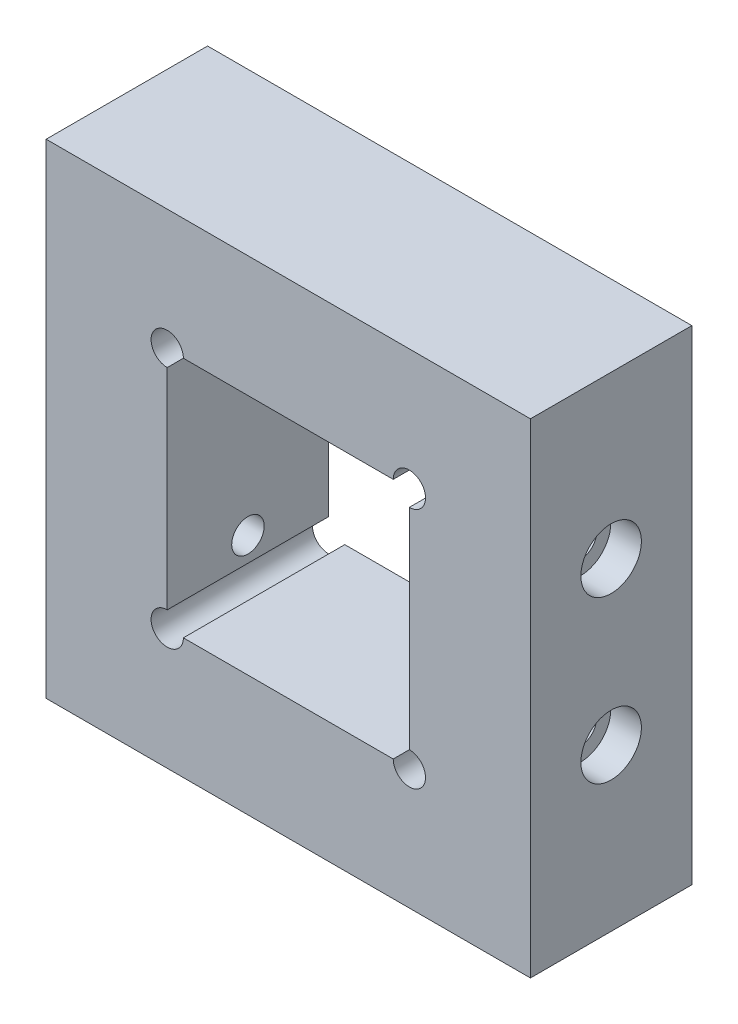
ISO-10303-21;
HEADER;
FILE_DESCRIPTION(('STEP AP214'),'2;1');
FILE_NAME('part.step','',(''),(''),'','','');
FILE_SCHEMA(('AUTOMOTIVE_DESIGN { 1 0 10303 214 1 1 1 1 }'));
ENDSEC;
DATA;
#1=APPLICATION_CONTEXT('core data for automotive mechanical design processes');
#2=APPLICATION_PROTOCOL_DEFINITION('international standard','automotive_design',2000,#1);
#3=PRODUCT_CONTEXT('',#1,'mechanical');
#4=PRODUCT('Part','Part','',(#3));
#5=PRODUCT_RELATED_PRODUCT_CATEGORY('part','',(#4));
#6=PRODUCT_DEFINITION_FORMATION('','',#4);
#7=PRODUCT_DEFINITION_CONTEXT('part definition',#1,'design');
#8=PRODUCT_DEFINITION('design','',#6,#7);
#9=PRODUCT_DEFINITION_SHAPE('','',#8);
#10=(LENGTH_UNIT() NAMED_UNIT(*) SI_UNIT(.MILLI.,.METRE.));
#11=(NAMED_UNIT(*) PLANE_ANGLE_UNIT() SI_UNIT($,.RADIAN.));
#12=(NAMED_UNIT(*) SI_UNIT($,.STERADIAN.) SOLID_ANGLE_UNIT());
#13=UNCERTAINTY_MEASURE_WITH_UNIT(LENGTH_MEASURE(1.E-05),#10,'distance_accuracy_value','');
#14=(GEOMETRIC_REPRESENTATION_CONTEXT(3) GLOBAL_UNCERTAINTY_ASSIGNED_CONTEXT((#13)) GLOBAL_UNIT_ASSIGNED_CONTEXT((#10,
#11,#12)) REPRESENTATION_CONTEXT('',''));
#15=CARTESIAN_POINT('',(0.,0.,0.));
#16=DIRECTION('',(0.,0.,1.));
#17=DIRECTION('',(1.,0.,0.));
#18=AXIS2_PLACEMENT_3D('',#15,#16,#17);
#19=CARTESIAN_POINT('',(0.,0.,12.7));
#20=DIRECTION('',(0.,0.,1.));
#21=DIRECTION('',(1.,0.,0.));
#22=AXIS2_PLACEMENT_3D('',#19,#20,#21);
#23=PLANE('',#22);
#24=DIRECTION('',(0.,-1.,0.));
#25=VECTOR('',#24,1.);
#26=CARTESIAN_POINT('',(-38.1,38.1,12.7));
#27=LINE('',#26,#25);
#28=CARTESIAN_POINT('',(-38.1,38.1,12.7));
#29=VERTEX_POINT('',#28);
#30=CARTESIAN_POINT('',(-38.1,-38.1,12.7));
#31=VERTEX_POINT('',#30);
#32=EDGE_CURVE('E158',#29,#31,#27,.T.);
#33=ORIENTED_EDGE('',*,*,#32,.T.);
#34=DIRECTION('',(1.,0.,0.));
#35=VECTOR('',#34,1.);
#36=CARTESIAN_POINT('',(-38.1,-38.1,12.7));
#37=LINE('',#36,#35);
#38=CARTESIAN_POINT('',(38.1,-38.1,12.7));
#39=VERTEX_POINT('',#38);
#40=EDGE_CURVE('E161',#31,#39,#37,.T.);
#41=ORIENTED_EDGE('',*,*,#40,.T.);
#42=DIRECTION('',(0.,1.,0.));
#43=VECTOR('',#42,1.);
#44=CARTESIAN_POINT('',(38.1,38.1,12.7));
#45=LINE('',#44,#43);
#46=CARTESIAN_POINT('',(38.1,38.1,12.7));
#47=VERTEX_POINT('',#46);
#48=EDGE_CURVE('E164',#39,#47,#45,.T.);
#49=ORIENTED_EDGE('',*,*,#48,.T.);
#50=DIRECTION('',(-1.,0.,0.));
#51=VECTOR('',#50,1.);
#52=CARTESIAN_POINT('',(-38.1,38.1,12.7));
#53=LINE('',#52,#51);
#54=EDGE_CURVE('E166',#47,#29,#53,.T.);
#55=ORIENTED_EDGE('',*,*,#54,.T.);
#56=EDGE_LOOP('',(#33,#41,#49,#55));
#57=FACE_BOUND('',#56,.T.);
#58=DIRECTION('',(1.,0.,0.));
#59=VECTOR('',#58,1.);
#60=CARTESIAN_POINT('',(-19.05,-19.05,12.7));
#61=LINE('',#60,#59);
#62=CARTESIAN_POINT('',(-16.51,-19.05,12.7));
#63=VERTEX_POINT('',#62);
#64=CARTESIAN_POINT('',(16.51,-19.05,12.7));
#65=VERTEX_POINT('',#64);
#66=EDGE_CURVE('E137',#63,#65,#61,.T.);
#67=ORIENTED_EDGE('',*,*,#66,.F.);
#68=CARTESIAN_POINT('',(-19.05,-19.05,12.7));
#69=DIRECTION('',(0.,0.,-1.));
#70=DIRECTION('',(-1.,0.,0.));
#71=AXIS2_PLACEMENT_3D('',#68,#69,#70);
#72=CIRCLE('',#71,2.54);
#73=CARTESIAN_POINT('',(-19.05,-16.51,12.7));
#74=VERTEX_POINT('',#73);
#75=EDGE_CURVE('E49',#63,#74,#72,.T.);
#76=ORIENTED_EDGE('',*,*,#75,.T.);
#77=DIRECTION('',(0.,-1.,0.));
#78=VECTOR('',#77,1.);
#79=CARTESIAN_POINT('',(-19.05,19.05,12.7));
#80=LINE('',#79,#78);
#81=CARTESIAN_POINT('',(-19.05,16.51,12.7));
#82=VERTEX_POINT('',#81);
#83=EDGE_CURVE('E135',#82,#74,#80,.T.);
#84=ORIENTED_EDGE('',*,*,#83,.F.);
#85=CARTESIAN_POINT('',(-19.05,19.05,12.7));
#86=DIRECTION('',(0.,0.,-1.));
#87=DIRECTION('',(-1.,0.,0.));
#88=AXIS2_PLACEMENT_3D('',#85,#86,#87);
#89=CIRCLE('',#88,2.54);
#90=CARTESIAN_POINT('',(-16.51,19.05,12.7));
#91=VERTEX_POINT('',#90);
#92=EDGE_CURVE('E257',#82,#91,#89,.T.);
#93=ORIENTED_EDGE('',*,*,#92,.T.);
#94=DIRECTION('',(-1.,0.,0.));
#95=VECTOR('',#94,1.);
#96=CARTESIAN_POINT('',(-19.05,19.05,12.7));
#97=LINE('',#96,#95);
#98=CARTESIAN_POINT('',(16.51,19.05,12.7));
#99=VERTEX_POINT('',#98);
#100=EDGE_CURVE('E154',#99,#91,#97,.T.);
#101=ORIENTED_EDGE('',*,*,#100,.F.);
#102=CARTESIAN_POINT('',(19.05,19.05,12.7));
#103=DIRECTION('',(0.,0.,1.));
#104=DIRECTION('',(1.,0.,0.));
#105=AXIS2_PLACEMENT_3D('',#102,#103,#104);
#106=CIRCLE('',#105,2.54);
#107=CARTESIAN_POINT('',(19.05,16.51,12.7));
#108=VERTEX_POINT('',#107);
#109=EDGE_CURVE('E298',#108,#99,#106,.T.);
#110=ORIENTED_EDGE('',*,*,#109,.F.);
#111=DIRECTION('',(0.,1.,0.));
#112=VECTOR('',#111,1.);
#113=CARTESIAN_POINT('',(19.05,19.05,12.7));
#114=LINE('',#113,#112);
#115=CARTESIAN_POINT('',(19.05,-16.51,12.7));
#116=VERTEX_POINT('',#115);
#117=EDGE_CURVE('E144',#116,#108,#114,.T.);
#118=ORIENTED_EDGE('',*,*,#117,.F.);
#119=CARTESIAN_POINT('',(19.05,-19.05,12.7));
#120=DIRECTION('',(0.,0.,1.));
#121=DIRECTION('',(1.,0.,0.));
#122=AXIS2_PLACEMENT_3D('',#119,#120,#121);
#123=CIRCLE('',#122,2.54);
#124=EDGE_CURVE('E288',#65,#116,#123,.T.);
#125=ORIENTED_EDGE('',*,*,#124,.F.);
#126=EDGE_LOOP('',(#67,#76,#84,#93,#101,#110,#118,#125));
#127=FACE_BOUND('',#126,.T.);
#128=ADVANCED_FACE('F34',(#57,#127),#23,.T.);
#129=CARTESIAN_POINT('',(0.,0.,-12.7));
#130=DIRECTION('',(0.,0.,1.));
#131=DIRECTION('',(1.,0.,0.));
#132=AXIS2_PLACEMENT_3D('',#129,#130,#131);
#133=PLANE('',#132);
#134=DIRECTION('',(0.,-1.,0.));
#135=VECTOR('',#134,1.);
#136=CARTESIAN_POINT('',(-38.1,38.1,-12.7));
#137=LINE('',#136,#135);
#138=CARTESIAN_POINT('',(-38.1,38.1,-12.7));
#139=VERTEX_POINT('',#138);
#140=CARTESIAN_POINT('',(-38.1,-38.1,-12.7));
#141=VERTEX_POINT('',#140);
#142=EDGE_CURVE('E169',#139,#141,#137,.T.);
#143=ORIENTED_EDGE('',*,*,#142,.F.);
#144=DIRECTION('',(-1.,0.,0.));
#145=VECTOR('',#144,1.);
#146=CARTESIAN_POINT('',(-38.1,38.1,-12.7));
#147=LINE('',#146,#145);
#148=CARTESIAN_POINT('',(38.1,38.1,-12.7));
#149=VERTEX_POINT('',#148);
#150=EDGE_CURVE('E162',#149,#139,#147,.T.);
#151=ORIENTED_EDGE('',*,*,#150,.F.);
#152=DIRECTION('',(0.,1.,0.));
#153=VECTOR('',#152,1.);
#154=CARTESIAN_POINT('',(38.1,38.1,-12.7));
#155=LINE('',#154,#153);
#156=CARTESIAN_POINT('',(38.1,-38.1,-12.7));
#157=VERTEX_POINT('',#156);
#158=EDGE_CURVE('E174',#157,#149,#155,.T.);
#159=ORIENTED_EDGE('',*,*,#158,.F.);
#160=DIRECTION('',(1.,0.,0.));
#161=VECTOR('',#160,1.);
#162=CARTESIAN_POINT('',(-38.1,-38.1,-12.7));
#163=LINE('',#162,#161);
#164=EDGE_CURVE('E172',#141,#157,#163,.T.);
#165=ORIENTED_EDGE('',*,*,#164,.F.);
#166=EDGE_LOOP('',(#143,#151,#159,#165));
#167=FACE_BOUND('',#166,.T.);
#168=CARTESIAN_POINT('',(-19.05,-19.05,-12.7));
#169=DIRECTION('',(0.,0.,1.));
#170=DIRECTION('',(1.,0.,0.));
#171=AXIS2_PLACEMENT_3D('',#168,#169,#170);
#172=CIRCLE('',#171,2.54);
#173=CARTESIAN_POINT('',(-19.05,-16.51,-12.7));
#174=VERTEX_POINT('',#173);
#175=CARTESIAN_POINT('',(-16.51,-19.05,-12.7));
#176=VERTEX_POINT('',#175);
#177=EDGE_CURVE('E124',#174,#176,#172,.T.);
#178=ORIENTED_EDGE('',*,*,#177,.T.);
#179=DIRECTION('',(1.,0.,0.));
#180=VECTOR('',#179,1.);
#181=CARTESIAN_POINT('',(-19.05,-19.05,-12.7));
#182=LINE('',#181,#180);
#183=CARTESIAN_POINT('',(16.51,-19.05,-12.7));
#184=VERTEX_POINT('',#183);
#185=EDGE_CURVE('E250',#176,#184,#182,.T.);
#186=ORIENTED_EDGE('',*,*,#185,.T.);
#187=CARTESIAN_POINT('',(19.05,-19.05,-12.7));
#188=DIRECTION('',(0.,0.,1.));
#189=DIRECTION('',(1.,0.,0.));
#190=AXIS2_PLACEMENT_3D('',#187,#188,#189);
#191=CIRCLE('',#190,2.54);
#192=CARTESIAN_POINT('',(19.05,-16.51,-12.7));
#193=VERTEX_POINT('',#192);
#194=EDGE_CURVE('E290',#193,#184,#191,.F.);
#195=ORIENTED_EDGE('',*,*,#194,.F.);
#196=DIRECTION('',(0.,1.,0.));
#197=VECTOR('',#196,1.);
#198=CARTESIAN_POINT('',(19.05,19.05,-12.7));
#199=LINE('',#198,#197);
#200=CARTESIAN_POINT('',(19.05,16.51,-12.7));
#201=VERTEX_POINT('',#200);
#202=EDGE_CURVE('E323',#193,#201,#199,.T.);
#203=ORIENTED_EDGE('',*,*,#202,.T.);
#204=CARTESIAN_POINT('',(19.05,19.05,-12.7));
#205=DIRECTION('',(0.,0.,1.));
#206=DIRECTION('',(1.,0.,0.));
#207=AXIS2_PLACEMENT_3D('',#204,#205,#206);
#208=CIRCLE('',#207,2.54);
#209=CARTESIAN_POINT('',(16.51,19.05,-12.7));
#210=VERTEX_POINT('',#209);
#211=EDGE_CURVE('E300',#210,#201,#208,.F.);
#212=ORIENTED_EDGE('',*,*,#211,.F.);
#213=DIRECTION('',(-1.,0.,0.));
#214=VECTOR('',#213,1.);
#215=CARTESIAN_POINT('',(-19.05,19.05,-12.7));
#216=LINE('',#215,#214);
#217=CARTESIAN_POINT('',(-16.51,19.05,-12.7));
#218=VERTEX_POINT('',#217);
#219=EDGE_CURVE('E150',#210,#218,#216,.T.);
#220=ORIENTED_EDGE('',*,*,#219,.T.);
#221=CARTESIAN_POINT('',(-19.05,19.05,-12.7));
#222=DIRECTION('',(0.,0.,1.));
#223=DIRECTION('',(1.,0.,0.));
#224=AXIS2_PLACEMENT_3D('',#221,#222,#223);
#225=CIRCLE('',#224,2.54);
#226=CARTESIAN_POINT('',(-19.05,16.51,-12.7));
#227=VERTEX_POINT('',#226);
#228=EDGE_CURVE('E57',#218,#227,#225,.T.);
#229=ORIENTED_EDGE('',*,*,#228,.T.);
#230=DIRECTION('',(0.,-1.,0.));
#231=VECTOR('',#230,1.);
#232=CARTESIAN_POINT('',(-19.05,19.05,-12.7));
#233=LINE('',#232,#231);
#234=EDGE_CURVE('E157',#227,#174,#233,.T.);
#235=ORIENTED_EDGE('',*,*,#234,.T.);
#236=EDGE_LOOP('',(#178,#186,#195,#203,#212,#220,#229,#235));
#237=FACE_BOUND('',#236,.T.);
#238=ADVANCED_FACE('F192',(#167,#237),#133,.F.);
#239=CARTESIAN_POINT('',(-19.05,19.05,-12.7));
#240=DIRECTION('',(-1.,0.,0.));
#241=DIRECTION('',(0.,-1.,0.));
#242=AXIS2_PLACEMENT_3D('',#239,#240,#241);
#243=PLANE('',#242);
#244=CARTESIAN_POINT('',(-19.05,12.7,0.));
#245=DIRECTION('',(-1.,0.,0.));
#246=DIRECTION('',(0.,-1.,0.));
#247=AXIS2_PLACEMENT_3D('',#244,#245,#246);
#248=CIRCLE('',#247,2.5527);
#249=CARTESIAN_POINT('',(-19.05,10.1473,0.));
#250=VERTEX_POINT('',#249);
#251=EDGE_CURVE('E269',#250,#250,#248,.T.);
#252=ORIENTED_EDGE('',*,*,#251,.T.);
#253=EDGE_LOOP('',(#252));
#254=FACE_BOUND('',#253,.T.);
#255=CARTESIAN_POINT('',(-19.05,-12.7,0.));
#256=DIRECTION('',(-1.,0.,0.));
#257=DIRECTION('',(0.,-1.,0.));
#258=AXIS2_PLACEMENT_3D('',#255,#256,#257);
#259=CIRCLE('',#258,2.5527);
#260=CARTESIAN_POINT('',(-19.05,-15.2527,0.));
#261=VERTEX_POINT('',#260);
#262=EDGE_CURVE('E281',#261,#261,#259,.T.);
#263=ORIENTED_EDGE('',*,*,#262,.T.);
#264=EDGE_LOOP('',(#263));
#265=FACE_BOUND('',#264,.T.);
#266=DIRECTION('',(0.,0.,1.));
#267=VECTOR('',#266,1.);
#268=CARTESIAN_POINT('',(-19.05,-16.51,-12.701));
#269=LINE('',#268,#267);
#270=EDGE_CURVE('E121',#74,#174,#269,.F.);
#271=ORIENTED_EDGE('',*,*,#270,.T.);
#272=ORIENTED_EDGE('',*,*,#234,.F.);
#273=DIRECTION('',(0.,0.,1.));
#274=VECTOR('',#273,1.);
#275=CARTESIAN_POINT('',(-19.05,16.51,-12.701));
#276=LINE('',#275,#274);
#277=EDGE_CURVE('E141',#227,#82,#276,.T.);
#278=ORIENTED_EDGE('',*,*,#277,.T.);
#279=ORIENTED_EDGE('',*,*,#83,.T.);
#280=EDGE_LOOP('',(#271,#272,#278,#279));
#281=FACE_BOUND('',#280,.T.);
#282=ADVANCED_FACE('F140',(#254,#265,#281),#243,.F.);
#283=CARTESIAN_POINT('',(-19.05,-19.05,-12.7));
#284=DIRECTION('',(0.,-1.,0.));
#285=DIRECTION('',(0.,0.,-1.));
#286=AXIS2_PLACEMENT_3D('',#283,#284,#285);
#287=PLANE('',#286);
#288=DIRECTION('',(0.,0.,1.));
#289=VECTOR('',#288,1.);
#290=CARTESIAN_POINT('',(-16.51,-19.05,-12.701));
#291=LINE('',#290,#289);
#292=EDGE_CURVE('E129',#176,#63,#291,.T.);
#293=ORIENTED_EDGE('',*,*,#292,.T.);
#294=ORIENTED_EDGE('',*,*,#66,.T.);
#295=DIRECTION('',(0.,0.,1.));
#296=VECTOR('',#295,1.);
#297=CARTESIAN_POINT('',(16.51,-19.05,-12.701));
#298=LINE('',#297,#296);
#299=EDGE_CURVE('E284',#184,#65,#298,.T.);
#300=ORIENTED_EDGE('',*,*,#299,.F.);
#301=ORIENTED_EDGE('',*,*,#185,.F.);
#302=EDGE_LOOP('',(#293,#294,#300,#301));
#303=FACE_BOUND('',#302,.T.);
#304=ADVANCED_FACE('F238',(#303),#287,.F.);
#305=CARTESIAN_POINT('',(-19.05,19.05,-12.7));
#306=DIRECTION('',(0.,1.,0.));
#307=DIRECTION('',(0.,0.,1.));
#308=AXIS2_PLACEMENT_3D('',#305,#306,#307);
#309=PLANE('',#308);
#310=DIRECTION('',(0.,0.,1.));
#311=VECTOR('',#310,1.);
#312=CARTESIAN_POINT('',(-16.51,19.05,-12.701));
#313=LINE('',#312,#311);
#314=EDGE_CURVE('E254',#91,#218,#313,.F.);
#315=ORIENTED_EDGE('',*,*,#314,.T.);
#316=ORIENTED_EDGE('',*,*,#219,.F.);
#317=DIRECTION('',(0.,0.,1.));
#318=VECTOR('',#317,1.);
#319=CARTESIAN_POINT('',(16.51,19.05,-12.701));
#320=LINE('',#319,#318);
#321=EDGE_CURVE('E296',#99,#210,#320,.F.);
#322=ORIENTED_EDGE('',*,*,#321,.F.);
#323=ORIENTED_EDGE('',*,*,#100,.T.);
#324=EDGE_LOOP('',(#315,#316,#322,#323));
#325=FACE_BOUND('',#324,.T.);
#326=ADVANCED_FACE('F210',(#325),#309,.F.);
#327=CARTESIAN_POINT('',(-38.1,38.1,12.7));
#328=DIRECTION('',(1.,0.,0.));
#329=DIRECTION('',(0.,1.,0.));
#330=AXIS2_PLACEMENT_3D('',#327,#328,#329);
#331=PLANE('',#330);
#332=CARTESIAN_POINT('',(-38.1,12.7,0.));
#333=DIRECTION('',(-1.,0.,0.));
#334=DIRECTION('',(0.,0.,1.));
#335=AXIS2_PLACEMENT_3D('',#332,#333,#334);
#336=CIRCLE('',#335,4.7625);
#337=CARTESIAN_POINT('',(-38.1,12.7,4.7625));
#338=VERTEX_POINT('',#337);
#339=EDGE_CURVE('E260',#338,#338,#336,.T.);
#340=ORIENTED_EDGE('',*,*,#339,.F.);
#341=EDGE_LOOP('',(#340));
#342=FACE_BOUND('',#341,.T.);
#343=CARTESIAN_POINT('',(-38.1,-12.7,0.));
#344=DIRECTION('',(-1.,0.,0.));
#345=DIRECTION('',(0.,0.,1.));
#346=AXIS2_PLACEMENT_3D('',#343,#344,#345);
#347=CIRCLE('',#346,4.7625);
#348=CARTESIAN_POINT('',(-38.1,-12.7,4.7625));
#349=VERTEX_POINT('',#348);
#350=EDGE_CURVE('E272',#349,#349,#347,.T.);
#351=ORIENTED_EDGE('',*,*,#350,.F.);
#352=EDGE_LOOP('',(#351));
#353=FACE_BOUND('',#352,.T.);
#354=ORIENTED_EDGE('',*,*,#142,.T.);
#355=DIRECTION('',(0.,0.,-1.));
#356=VECTOR('',#355,1.);
#357=CARTESIAN_POINT('',(-38.1,-38.1,12.7));
#358=LINE('',#357,#356);
#359=EDGE_CURVE('E11',#31,#141,#358,.T.);
#360=ORIENTED_EDGE('',*,*,#359,.F.);
#361=ORIENTED_EDGE('',*,*,#32,.F.);
#362=DIRECTION('',(0.,0.,-1.));
#363=VECTOR('',#362,1.);
#364=CARTESIAN_POINT('',(-38.1,38.1,12.7));
#365=LINE('',#364,#363);
#366=EDGE_CURVE('E168',#29,#139,#365,.T.);
#367=ORIENTED_EDGE('',*,*,#366,.T.);
#368=EDGE_LOOP('',(#354,#360,#361,#367));
#369=FACE_BOUND('',#368,.T.);
#370=ADVANCED_FACE('F36',(#342,#353,#369),#331,.F.);
#371=CARTESIAN_POINT('',(-38.1,-38.1,12.7));
#372=DIRECTION('',(0.,1.,0.));
#373=DIRECTION('',(0.,0.,1.));
#374=AXIS2_PLACEMENT_3D('',#371,#372,#373);
#375=PLANE('',#374);
#376=ORIENTED_EDGE('',*,*,#164,.T.);
#377=DIRECTION('',(0.,0.,-1.));
#378=VECTOR('',#377,1.);
#379=CARTESIAN_POINT('',(38.1,-38.1,12.7));
#380=LINE('',#379,#378);
#381=EDGE_CURVE('E42',#39,#157,#380,.T.);
#382=ORIENTED_EDGE('',*,*,#381,.F.);
#383=ORIENTED_EDGE('',*,*,#40,.F.);
#384=ORIENTED_EDGE('',*,*,#359,.T.);
#385=EDGE_LOOP('',(#376,#382,#383,#384));
#386=FACE_BOUND('',#385,.T.);
#387=ADVANCED_FACE('F202',(#386),#375,.F.);
#388=CARTESIAN_POINT('',(38.1,38.1,12.7));
#389=DIRECTION('',(-1.,0.,0.));
#390=DIRECTION('',(0.,-1.,0.));
#391=AXIS2_PLACEMENT_3D('',#388,#389,#390);
#392=PLANE('',#391);
#393=CARTESIAN_POINT('',(38.1,12.7,0.));
#394=DIRECTION('',(1.,0.,0.));
#395=DIRECTION('',(0.,0.,-1.));
#396=AXIS2_PLACEMENT_3D('',#393,#394,#395);
#397=CIRCLE('',#396,4.7625);
#398=CARTESIAN_POINT('',(38.1,12.7,-4.7625));
#399=VERTEX_POINT('',#398);
#400=EDGE_CURVE('E303',#399,#399,#397,.T.);
#401=ORIENTED_EDGE('',*,*,#400,.F.);
#402=EDGE_LOOP('',(#401));
#403=FACE_BOUND('',#402,.T.);
#404=CARTESIAN_POINT('',(38.1,-12.7,0.));
#405=DIRECTION('',(1.,0.,0.));
#406=DIRECTION('',(0.,0.,-1.));
#407=AXIS2_PLACEMENT_3D('',#404,#405,#406);
#408=CIRCLE('',#407,4.7625);
#409=CARTESIAN_POINT('',(38.1,-12.7,-4.7625));
#410=VERTEX_POINT('',#409);
#411=EDGE_CURVE('E314',#410,#410,#408,.T.);
#412=ORIENTED_EDGE('',*,*,#411,.F.);
#413=EDGE_LOOP('',(#412));
#414=FACE_BOUND('',#413,.T.);
#415=ORIENTED_EDGE('',*,*,#158,.T.);
#416=DIRECTION('',(0.,0.,-1.));
#417=VECTOR('',#416,1.);
#418=CARTESIAN_POINT('',(38.1,38.1,12.7));
#419=LINE('',#418,#417);
#420=EDGE_CURVE('E179',#47,#149,#419,.T.);
#421=ORIENTED_EDGE('',*,*,#420,.F.);
#422=ORIENTED_EDGE('',*,*,#48,.F.);
#423=ORIENTED_EDGE('',*,*,#381,.T.);
#424=EDGE_LOOP('',(#415,#421,#422,#423));
#425=FACE_BOUND('',#424,.T.);
#426=ADVANCED_FACE('F186',(#403,#414,#425),#392,.F.);
#427=CARTESIAN_POINT('',(-38.1,38.1,12.7));
#428=DIRECTION('',(0.,-1.,0.));
#429=DIRECTION('',(0.,0.,-1.));
#430=AXIS2_PLACEMENT_3D('',#427,#428,#429);
#431=PLANE('',#430);
#432=ORIENTED_EDGE('',*,*,#150,.T.);
#433=ORIENTED_EDGE('',*,*,#366,.F.);
#434=ORIENTED_EDGE('',*,*,#54,.F.);
#435=ORIENTED_EDGE('',*,*,#420,.T.);
#436=EDGE_LOOP('',(#432,#433,#434,#435));
#437=FACE_BOUND('',#436,.T.);
#438=ADVANCED_FACE('F196',(#437),#431,.F.);
#439=CARTESIAN_POINT('',(19.05,19.05,-12.7));
#440=DIRECTION('',(1.,0.,0.));
#441=DIRECTION('',(0.,1.,0.));
#442=AXIS2_PLACEMENT_3D('',#439,#440,#441);
#443=PLANE('',#442);
#444=CARTESIAN_POINT('',(19.05,12.7,0.));
#445=DIRECTION('',(1.,0.,0.));
#446=DIRECTION('',(0.,1.,0.));
#447=AXIS2_PLACEMENT_3D('',#444,#445,#446);
#448=CIRCLE('',#447,2.5527);
#449=CARTESIAN_POINT('',(19.05,15.2527,0.));
#450=VERTEX_POINT('',#449);
#451=EDGE_CURVE('E312',#450,#450,#448,.T.);
#452=ORIENTED_EDGE('',*,*,#451,.T.);
#453=EDGE_LOOP('',(#452));
#454=FACE_BOUND('',#453,.T.);
#455=CARTESIAN_POINT('',(19.05,-12.7,0.));
#456=DIRECTION('',(1.,0.,0.));
#457=DIRECTION('',(0.,1.,0.));
#458=AXIS2_PLACEMENT_3D('',#455,#456,#457);
#459=CIRCLE('',#458,2.5527);
#460=CARTESIAN_POINT('',(19.05,-10.1473,0.));
#461=VERTEX_POINT('',#460);
#462=EDGE_CURVE('E142',#461,#461,#459,.T.);
#463=ORIENTED_EDGE('',*,*,#462,.T.);
#464=EDGE_LOOP('',(#463));
#465=FACE_BOUND('',#464,.T.);
#466=ORIENTED_EDGE('',*,*,#202,.F.);
#467=DIRECTION('',(0.,0.,1.));
#468=VECTOR('',#467,1.);
#469=CARTESIAN_POINT('',(19.05,-16.51,-12.701));
#470=LINE('',#469,#468);
#471=EDGE_CURVE('E286',#116,#193,#470,.F.);
#472=ORIENTED_EDGE('',*,*,#471,.F.);
#473=ORIENTED_EDGE('',*,*,#117,.T.);
#474=DIRECTION('',(0.,0.,1.));
#475=VECTOR('',#474,1.);
#476=CARTESIAN_POINT('',(19.05,16.51,-12.701));
#477=LINE('',#476,#475);
#478=EDGE_CURVE('E293',#201,#108,#477,.T.);
#479=ORIENTED_EDGE('',*,*,#478,.F.);
#480=EDGE_LOOP('',(#466,#472,#473,#479));
#481=FACE_BOUND('',#480,.T.);
#482=ADVANCED_FACE('F222',(#454,#465,#481),#443,.F.);
#483=CARTESIAN_POINT('',(38.1,-12.7,0.));
#484=DIRECTION('',(1.,0.,0.));
#485=DIRECTION('',(0.,0.,-1.));
#486=AXIS2_PLACEMENT_3D('',#483,#484,#485);
#487=CYLINDRICAL_SURFACE('',#486,2.5527);
#488=ORIENTED_EDGE('',*,*,#462,.F.);
#489=EDGE_LOOP('',(#488));
#490=FACE_BOUND('',#489,.T.);
#491=CARTESIAN_POINT('',(33.274,-12.7,0.));
#492=DIRECTION('',(1.,0.,0.));
#493=DIRECTION('',(0.,0.,-1.));
#494=AXIS2_PLACEMENT_3D('',#491,#492,#493);
#495=CIRCLE('',#494,2.55270000000001);
#496=CARTESIAN_POINT('',(33.274,-12.7,-2.55270000000001));
#497=VERTEX_POINT('',#496);
#498=EDGE_CURVE('E147',#497,#497,#495,.T.);
#499=ORIENTED_EDGE('',*,*,#498,.T.);
#500=EDGE_LOOP('',(#499));
#501=FACE_BOUND('',#500,.T.);
#502=ADVANCED_FACE('F226',(#490,#501),#487,.F.);
#503=CARTESIAN_POINT('',(33.274,-10.1473,0.));
#504=DIRECTION('',(-1.,0.,0.));
#505=DIRECTION('',(0.,0.,1.));
#506=AXIS2_PLACEMENT_3D('',#503,#504,#505);
#507=PLANE('',#506);
#508=ORIENTED_EDGE('',*,*,#498,.F.);
#509=EDGE_LOOP('',(#508));
#510=FACE_BOUND('',#509,.T.);
#511=CARTESIAN_POINT('',(33.274,-12.7,0.));
#512=DIRECTION('',(1.,0.,0.));
#513=DIRECTION('',(0.,0.,-1.));
#514=AXIS2_PLACEMENT_3D('',#511,#512,#513);
#515=CIRCLE('',#514,4.7625);
#516=CARTESIAN_POINT('',(33.274,-12.7,-4.7625));
#517=VERTEX_POINT('',#516);
#518=EDGE_CURVE('E317',#517,#517,#515,.T.);
#519=ORIENTED_EDGE('',*,*,#518,.T.);
#520=EDGE_LOOP('',(#519));
#521=FACE_BOUND('',#520,.T.);
#522=ADVANCED_FACE('F232',(#510,#521),#507,.F.);
#523=CARTESIAN_POINT('',(38.1,-12.7,0.));
#524=DIRECTION('',(1.,0.,0.));
#525=DIRECTION('',(0.,0.,-1.));
#526=AXIS2_PLACEMENT_3D('',#523,#524,#525);
#527=CYLINDRICAL_SURFACE('',#526,4.7625);
#528=ORIENTED_EDGE('',*,*,#518,.F.);
#529=EDGE_LOOP('',(#528));
#530=FACE_BOUND('',#529,.T.);
#531=ORIENTED_EDGE('',*,*,#411,.T.);
#532=EDGE_LOOP('',(#531));
#533=FACE_BOUND('',#532,.T.);
#534=ADVANCED_FACE('F365',(#530,#533),#527,.F.);
#535=CARTESIAN_POINT('',(38.1,12.7,0.));
#536=DIRECTION('',(1.,0.,0.));
#537=DIRECTION('',(0.,0.,-1.));
#538=AXIS2_PLACEMENT_3D('',#535,#536,#537);
#539=CYLINDRICAL_SURFACE('',#538,2.5527);
#540=ORIENTED_EDGE('',*,*,#451,.F.);
#541=EDGE_LOOP('',(#540));
#542=FACE_BOUND('',#541,.T.);
#543=CARTESIAN_POINT('',(33.274,12.7,0.));
#544=DIRECTION('',(1.,0.,0.));
#545=DIRECTION('',(0.,0.,-1.));
#546=AXIS2_PLACEMENT_3D('',#543,#544,#545);
#547=CIRCLE('',#546,2.55270000000001);
#548=CARTESIAN_POINT('',(33.274,12.7,-2.55270000000001));
#549=VERTEX_POINT('',#548);
#550=EDGE_CURVE('E309',#549,#549,#547,.T.);
#551=ORIENTED_EDGE('',*,*,#550,.T.);
#552=EDGE_LOOP('',(#551));
#553=FACE_BOUND('',#552,.T.);
#554=ADVANCED_FACE('F361',(#542,#553),#539,.F.);
#555=CARTESIAN_POINT('',(33.274,15.2527,0.));
#556=DIRECTION('',(-1.,0.,0.));
#557=DIRECTION('',(0.,0.,1.));
#558=AXIS2_PLACEMENT_3D('',#555,#556,#557);
#559=PLANE('',#558);
#560=ORIENTED_EDGE('',*,*,#550,.F.);
#561=EDGE_LOOP('',(#560));
#562=FACE_BOUND('',#561,.T.);
#563=CARTESIAN_POINT('',(33.274,12.7,0.));
#564=DIRECTION('',(1.,0.,0.));
#565=DIRECTION('',(0.,0.,-1.));
#566=AXIS2_PLACEMENT_3D('',#563,#564,#565);
#567=CIRCLE('',#566,4.7625);
#568=CARTESIAN_POINT('',(33.274,12.7,-4.7625));
#569=VERTEX_POINT('',#568);
#570=EDGE_CURVE('E306',#569,#569,#567,.T.);
#571=ORIENTED_EDGE('',*,*,#570,.T.);
#572=EDGE_LOOP('',(#571));
#573=FACE_BOUND('',#572,.T.);
#574=ADVANCED_FACE('F357',(#562,#573),#559,.F.);
#575=CARTESIAN_POINT('',(38.1,12.7,0.));
#576=DIRECTION('',(1.,0.,0.));
#577=DIRECTION('',(0.,0.,-1.));
#578=AXIS2_PLACEMENT_3D('',#575,#576,#577);
#579=CYLINDRICAL_SURFACE('',#578,4.7625);
#580=ORIENTED_EDGE('',*,*,#570,.F.);
#581=EDGE_LOOP('',(#580));
#582=FACE_BOUND('',#581,.T.);
#583=ORIENTED_EDGE('',*,*,#400,.T.);
#584=EDGE_LOOP('',(#583));
#585=FACE_BOUND('',#584,.T.);
#586=ADVANCED_FACE('F351',(#582,#585),#579,.F.);
#587=CARTESIAN_POINT('',(19.05,19.05,-12.701));
#588=DIRECTION('',(0.,0.,1.));
#589=DIRECTION('',(1.,0.,0.));
#590=AXIS2_PLACEMENT_3D('',#587,#588,#589);
#591=CYLINDRICAL_SURFACE('',#590,2.54);
#592=ORIENTED_EDGE('',*,*,#321,.T.);
#593=ORIENTED_EDGE('',*,*,#211,.T.);
#594=ORIENTED_EDGE('',*,*,#478,.T.);
#595=ORIENTED_EDGE('',*,*,#109,.T.);
#596=EDGE_LOOP('',(#592,#593,#594,#595));
#597=FACE_BOUND('',#596,.T.);
#598=ADVANCED_FACE('F335',(#597),#591,.F.);
#599=CARTESIAN_POINT('',(19.05,-19.05,-12.701));
#600=DIRECTION('',(0.,0.,1.));
#601=DIRECTION('',(1.,0.,0.));
#602=AXIS2_PLACEMENT_3D('',#599,#600,#601);
#603=CYLINDRICAL_SURFACE('',#602,2.54);
#604=ORIENTED_EDGE('',*,*,#471,.T.);
#605=ORIENTED_EDGE('',*,*,#194,.T.);
#606=ORIENTED_EDGE('',*,*,#299,.T.);
#607=ORIENTED_EDGE('',*,*,#124,.T.);
#608=EDGE_LOOP('',(#604,#605,#606,#607));
#609=FACE_BOUND('',#608,.T.);
#610=ADVANCED_FACE('F340',(#609),#603,.F.);
#611=CARTESIAN_POINT('',(-38.1,-12.7,0.));
#612=DIRECTION('',(-1.,0.,0.));
#613=DIRECTION('',(0.,0.,1.));
#614=AXIS2_PLACEMENT_3D('',#611,#612,#613);
#615=CYLINDRICAL_SURFACE('',#614,2.5527);
#616=ORIENTED_EDGE('',*,*,#262,.F.);
#617=EDGE_LOOP('',(#616));
#618=FACE_BOUND('',#617,.T.);
#619=CARTESIAN_POINT('',(-33.274,-12.7,0.));
#620=DIRECTION('',(-1.,0.,0.));
#621=DIRECTION('',(0.,0.,1.));
#622=AXIS2_PLACEMENT_3D('',#619,#620,#621);
#623=CIRCLE('',#622,2.55270000000001);
#624=CARTESIAN_POINT('',(-33.274,-12.7,2.55270000000001));
#625=VERTEX_POINT('',#624);
#626=EDGE_CURVE('E278',#625,#625,#623,.T.);
#627=ORIENTED_EDGE('',*,*,#626,.T.);
#628=EDGE_LOOP('',(#627));
#629=FACE_BOUND('',#628,.T.);
#630=ADVANCED_FACE('F342',(#618,#629),#615,.F.);
#631=CARTESIAN_POINT('',(-33.274,-10.1473,0.));
#632=DIRECTION('',(1.,0.,0.));
#633=DIRECTION('',(0.,0.,-1.));
#634=AXIS2_PLACEMENT_3D('',#631,#632,#633);
#635=PLANE('',#634);
#636=ORIENTED_EDGE('',*,*,#626,.F.);
#637=EDGE_LOOP('',(#636));
#638=FACE_BOUND('',#637,.T.);
#639=CARTESIAN_POINT('',(-33.274,-12.7,0.));
#640=DIRECTION('',(-1.,0.,0.));
#641=DIRECTION('',(0.,0.,1.));
#642=AXIS2_PLACEMENT_3D('',#639,#640,#641);
#643=CIRCLE('',#642,4.7625);
#644=CARTESIAN_POINT('',(-33.274,-12.7,4.7625));
#645=VERTEX_POINT('',#644);
#646=EDGE_CURVE('E275',#645,#645,#643,.T.);
#647=ORIENTED_EDGE('',*,*,#646,.T.);
#648=EDGE_LOOP('',(#647));
#649=FACE_BOUND('',#648,.T.);
#650=ADVANCED_FACE('F348',(#638,#649),#635,.F.);
#651=CARTESIAN_POINT('',(-38.1,-12.7,0.));
#652=DIRECTION('',(-1.,0.,0.));
#653=DIRECTION('',(0.,0.,1.));
#654=AXIS2_PLACEMENT_3D('',#651,#652,#653);
#655=CYLINDRICAL_SURFACE('',#654,4.7625);
#656=ORIENTED_EDGE('',*,*,#646,.F.);
#657=EDGE_LOOP('',(#656));
#658=FACE_BOUND('',#657,.T.);
#659=ORIENTED_EDGE('',*,*,#350,.T.);
#660=EDGE_LOOP('',(#659));
#661=FACE_BOUND('',#660,.T.);
#662=ADVANCED_FACE('F459',(#658,#661),#655,.F.);
#663=CARTESIAN_POINT('',(-38.1,12.7,0.));
#664=DIRECTION('',(-1.,0.,0.));
#665=DIRECTION('',(0.,0.,1.));
#666=AXIS2_PLACEMENT_3D('',#663,#664,#665);
#667=CYLINDRICAL_SURFACE('',#666,2.5527);
#668=ORIENTED_EDGE('',*,*,#251,.F.);
#669=EDGE_LOOP('',(#668));
#670=FACE_BOUND('',#669,.T.);
#671=CARTESIAN_POINT('',(-33.274,12.7,0.));
#672=DIRECTION('',(-1.,0.,0.));
#673=DIRECTION('',(0.,0.,1.));
#674=AXIS2_PLACEMENT_3D('',#671,#672,#673);
#675=CIRCLE('',#674,2.55270000000001);
#676=CARTESIAN_POINT('',(-33.274,12.7,2.55270000000001));
#677=VERTEX_POINT('',#676);
#678=EDGE_CURVE('E266',#677,#677,#675,.T.);
#679=ORIENTED_EDGE('',*,*,#678,.T.);
#680=EDGE_LOOP('',(#679));
#681=FACE_BOUND('',#680,.T.);
#682=ADVANCED_FACE('F468',(#670,#681),#667,.F.);
#683=CARTESIAN_POINT('',(-33.274,15.2527,0.));
#684=DIRECTION('',(1.,0.,0.));
#685=DIRECTION('',(0.,0.,-1.));
#686=AXIS2_PLACEMENT_3D('',#683,#684,#685);
#687=PLANE('',#686);
#688=ORIENTED_EDGE('',*,*,#678,.F.);
#689=EDGE_LOOP('',(#688));
#690=FACE_BOUND('',#689,.T.);
#691=CARTESIAN_POINT('',(-33.274,12.7,0.));
#692=DIRECTION('',(-1.,0.,0.));
#693=DIRECTION('',(0.,0.,1.));
#694=AXIS2_PLACEMENT_3D('',#691,#692,#693);
#695=CIRCLE('',#694,4.7625);
#696=CARTESIAN_POINT('',(-33.274,12.7,4.7625));
#697=VERTEX_POINT('',#696);
#698=EDGE_CURVE('E263',#697,#697,#695,.T.);
#699=ORIENTED_EDGE('',*,*,#698,.T.);
#700=EDGE_LOOP('',(#699));
#701=FACE_BOUND('',#700,.T.);
#702=ADVANCED_FACE('F478',(#690,#701),#687,.F.);
#703=CARTESIAN_POINT('',(-38.1,12.7,0.));
#704=DIRECTION('',(-1.,0.,0.));
#705=DIRECTION('',(0.,0.,1.));
#706=AXIS2_PLACEMENT_3D('',#703,#704,#705);
#707=CYLINDRICAL_SURFACE('',#706,4.7625);
#708=ORIENTED_EDGE('',*,*,#698,.F.);
#709=EDGE_LOOP('',(#708));
#710=FACE_BOUND('',#709,.T.);
#711=ORIENTED_EDGE('',*,*,#339,.T.);
#712=EDGE_LOOP('',(#711));
#713=FACE_BOUND('',#712,.T.);
#714=ADVANCED_FACE('F488',(#710,#713),#707,.F.);
#715=CARTESIAN_POINT('',(-19.05,19.05,-12.701));
#716=DIRECTION('',(0.,0.,1.));
#717=DIRECTION('',(1.,0.,0.));
#718=AXIS2_PLACEMENT_3D('',#715,#716,#717);
#719=CYLINDRICAL_SURFACE('',#718,2.54);
#720=ORIENTED_EDGE('',*,*,#228,.F.);
#721=ORIENTED_EDGE('',*,*,#314,.F.);
#722=ORIENTED_EDGE('',*,*,#92,.F.);
#723=ORIENTED_EDGE('',*,*,#277,.F.);
#724=EDGE_LOOP('',(#720,#721,#722,#723));
#725=FACE_BOUND('',#724,.T.);
#726=ADVANCED_FACE('F331',(#725),#719,.F.);
#727=CARTESIAN_POINT('',(-19.05,-19.05,-12.701));
#728=DIRECTION('',(0.,0.,1.));
#729=DIRECTION('',(1.,0.,0.));
#730=AXIS2_PLACEMENT_3D('',#727,#728,#729);
#731=CYLINDRICAL_SURFACE('',#730,2.54);
#732=ORIENTED_EDGE('',*,*,#75,.F.);
#733=ORIENTED_EDGE('',*,*,#292,.F.);
#734=ORIENTED_EDGE('',*,*,#177,.F.);
#735=ORIENTED_EDGE('',*,*,#270,.F.);
#736=EDGE_LOOP('',(#732,#733,#734,#735));
#737=FACE_BOUND('',#736,.T.);
#738=ADVANCED_FACE('F122',(#737),#731,.F.);
#739=CLOSED_SHELL('',(#128,#238,#282,#304,#326,#370,#387,#426,#438,#482,#502,#522,#534,#554,
#574,#586,#598,#610,#630,#650,#662,#682,#702,#714,#726,#738));
#740=MANIFOLD_SOLID_BREP('B2',#739);
#741=ADVANCED_BREP_SHAPE_REPRESENTATION('',(#18,#740),#14);
#742=SHAPE_DEFINITION_REPRESENTATION(#9,#741);
ENDSEC;
END-ISO-10303-21;
